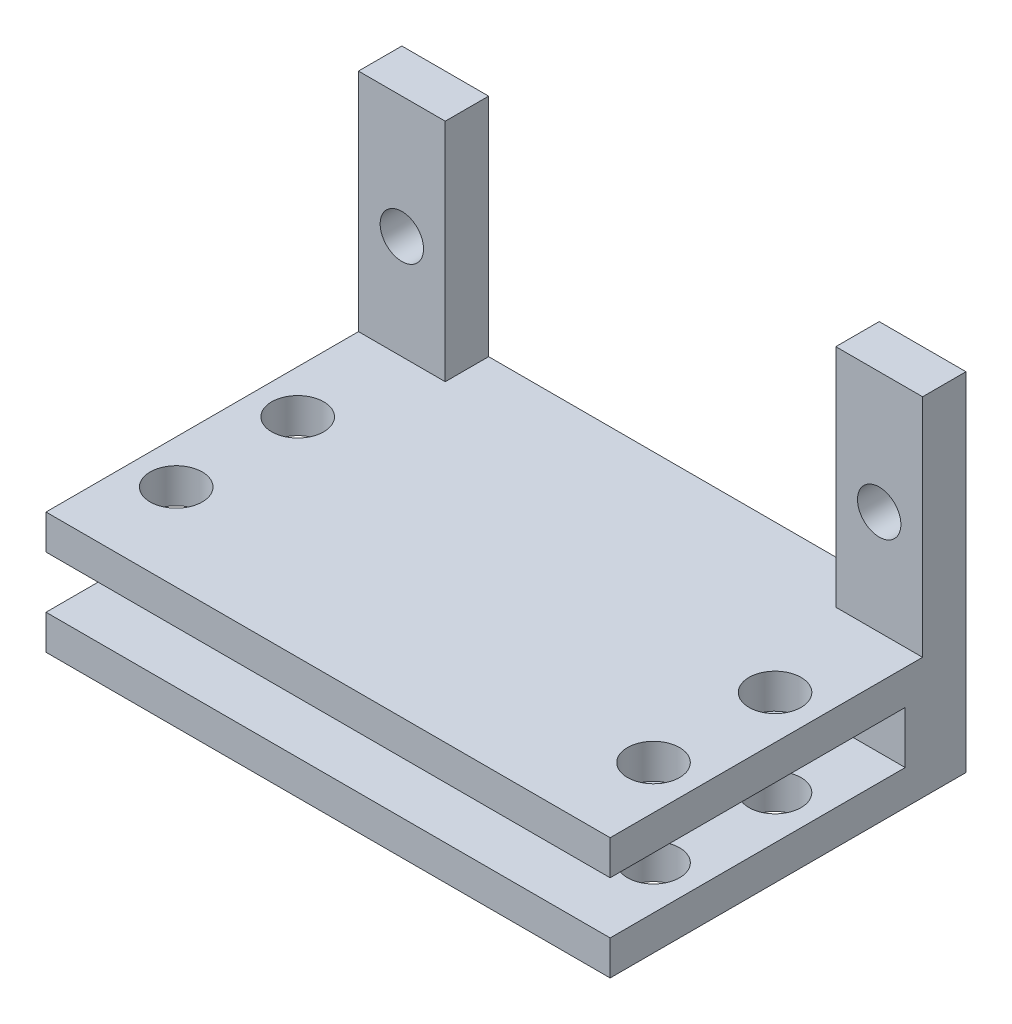
ISO-10303-21;
HEADER;
FILE_DESCRIPTION(('STEP AP214'),'2;1');
FILE_NAME('part.step','',(''),(''),'','','');
FILE_SCHEMA(('AUTOMOTIVE_DESIGN { 1 0 10303 214 1 1 1 1 }'));
ENDSEC;
DATA;
#1=APPLICATION_CONTEXT('core data for automotive mechanical design processes');
#2=APPLICATION_PROTOCOL_DEFINITION('international standard','automotive_design',2000,#1);
#3=PRODUCT_CONTEXT('',#1,'mechanical');
#4=PRODUCT('Part','Part','',(#3));
#5=PRODUCT_RELATED_PRODUCT_CATEGORY('part','',(#4));
#6=PRODUCT_DEFINITION_FORMATION('','',#4);
#7=PRODUCT_DEFINITION_CONTEXT('part definition',#1,'design');
#8=PRODUCT_DEFINITION('design','',#6,#7);
#9=PRODUCT_DEFINITION_SHAPE('','',#8);
#10=(LENGTH_UNIT() NAMED_UNIT(*) SI_UNIT(.MILLI.,.METRE.));
#11=(NAMED_UNIT(*) PLANE_ANGLE_UNIT() SI_UNIT($,.RADIAN.));
#12=(NAMED_UNIT(*) SI_UNIT($,.STERADIAN.) SOLID_ANGLE_UNIT());
#13=UNCERTAINTY_MEASURE_WITH_UNIT(LENGTH_MEASURE(1.E-05),#10,'distance_accuracy_value','');
#14=(GEOMETRIC_REPRESENTATION_CONTEXT(3) GLOBAL_UNCERTAINTY_ASSIGNED_CONTEXT((#13)) GLOBAL_UNIT_ASSIGNED_CONTEXT((#10,
#11,#12)) REPRESENTATION_CONTEXT('',''));
#15=CARTESIAN_POINT('',(0.,0.,0.));
#16=DIRECTION('',(0.,0.,1.));
#17=DIRECTION('',(1.,0.,0.));
#18=AXIS2_PLACEMENT_3D('',#15,#16,#17);
#19=CARTESIAN_POINT('',(0.,0.,20.5));
#20=DIRECTION('',(0.,1.,0.));
#21=DIRECTION('',(-1.,0.,0.));
#22=AXIS2_PLACEMENT_3D('',#19,#20,#21);
#23=PLANE('',#22);
#24=CARTESIAN_POINT('',(-13.75,0.,8.5));
#25=DIRECTION('',(0.,1.,0.));
#26=DIRECTION('',(-1.,0.,0.));
#27=AXIS2_PLACEMENT_3D('',#24,#25,#26);
#28=CIRCLE('',#27,1.5);
#29=CARTESIAN_POINT('',(-15.25,0.,8.5));
#30=VERTEX_POINT('',#29);
#31=EDGE_CURVE('E176',#30,#30,#28,.T.);
#32=ORIENTED_EDGE('',*,*,#31,.F.);
#33=EDGE_LOOP('',(#32));
#34=FACE_BOUND('',#33,.T.);
#35=CARTESIAN_POINT('',(-13.75,0.,15.5));
#36=DIRECTION('',(0.,1.,0.));
#37=DIRECTION('',(-1.,0.,0.));
#38=AXIS2_PLACEMENT_3D('',#35,#36,#37);
#39=CIRCLE('',#38,1.5);
#40=CARTESIAN_POINT('',(-15.25,0.,15.5));
#41=VERTEX_POINT('',#40);
#42=EDGE_CURVE('E417',#41,#41,#39,.T.);
#43=ORIENTED_EDGE('',*,*,#42,.F.);
#44=EDGE_LOOP('',(#43));
#45=FACE_BOUND('',#44,.T.);
#46=CARTESIAN_POINT('',(13.75,0.,15.5));
#47=DIRECTION('',(0.,1.,0.));
#48=DIRECTION('',(-1.,0.,0.));
#49=AXIS2_PLACEMENT_3D('',#46,#47,#48);
#50=CIRCLE('',#49,1.5);
#51=CARTESIAN_POINT('',(12.25,0.,15.5));
#52=VERTEX_POINT('',#51);
#53=EDGE_CURVE('E399',#52,#52,#50,.T.);
#54=ORIENTED_EDGE('',*,*,#53,.F.);
#55=EDGE_LOOP('',(#54));
#56=FACE_BOUND('',#55,.T.);
#57=CARTESIAN_POINT('',(13.75,0.,8.5));
#58=DIRECTION('',(0.,1.,0.));
#59=DIRECTION('',(-1.,0.,0.));
#60=AXIS2_PLACEMENT_3D('',#57,#58,#59);
#61=CIRCLE('',#60,1.5);
#62=CARTESIAN_POINT('',(12.25,0.,8.5));
#63=VERTEX_POINT('',#62);
#64=EDGE_CURVE('E408',#63,#63,#61,.T.);
#65=ORIENTED_EDGE('',*,*,#64,.F.);
#66=EDGE_LOOP('',(#65));
#67=FACE_BOUND('',#66,.T.);
#68=DIRECTION('',(1.,0.,0.));
#69=VECTOR('',#68,1.);
#70=CARTESIAN_POINT('',(0.,0.,0.));
#71=LINE('',#70,#69);
#72=CARTESIAN_POINT('',(-11.25,0.,0.));
#73=VERTEX_POINT('',#72);
#74=CARTESIAN_POINT('',(11.25,0.,0.));
#75=VERTEX_POINT('',#74);
#76=EDGE_CURVE('E220',#73,#75,#71,.T.);
#77=ORIENTED_EDGE('',*,*,#76,.F.);
#78=DIRECTION('',(0.,0.,-1.));
#79=VECTOR('',#78,1.);
#80=CARTESIAN_POINT('',(-11.25,0.,2.5));
#81=LINE('',#80,#79);
#82=CARTESIAN_POINT('',(-11.25,0.,2.5));
#83=VERTEX_POINT('',#82);
#84=EDGE_CURVE('E217',#83,#73,#81,.T.);
#85=ORIENTED_EDGE('',*,*,#84,.F.);
#86=DIRECTION('',(1.,0.,0.));
#87=VECTOR('',#86,1.);
#88=CARTESIAN_POINT('',(0.,0.,2.5));
#89=LINE('',#88,#87);
#90=CARTESIAN_POINT('',(-16.25,0.,2.5));
#91=VERTEX_POINT('',#90);
#92=EDGE_CURVE('E193',#91,#83,#89,.T.);
#93=ORIENTED_EDGE('',*,*,#92,.F.);
#94=DIRECTION('',(0.,0.,-1.));
#95=VECTOR('',#94,1.);
#96=CARTESIAN_POINT('',(-16.25,0.,20.5));
#97=LINE('',#96,#95);
#98=CARTESIAN_POINT('',(-16.25,0.,20.5));
#99=VERTEX_POINT('',#98);
#100=EDGE_CURVE('E237',#99,#91,#97,.T.);
#101=ORIENTED_EDGE('',*,*,#100,.F.);
#102=DIRECTION('',(1.,0.,0.));
#103=VECTOR('',#102,1.);
#104=CARTESIAN_POINT('',(0.,0.,20.5));
#105=LINE('',#104,#103);
#106=CARTESIAN_POINT('',(16.25,0.,20.5));
#107=VERTEX_POINT('',#106);
#108=EDGE_CURVE('E227',#99,#107,#105,.T.);
#109=ORIENTED_EDGE('',*,*,#108,.T.);
#110=DIRECTION('',(0.,0.,-1.));
#111=VECTOR('',#110,1.);
#112=CARTESIAN_POINT('',(16.25,0.,20.5));
#113=LINE('',#112,#111);
#114=CARTESIAN_POINT('',(16.25,0.,2.5));
#115=VERTEX_POINT('',#114);
#116=EDGE_CURVE('E240',#107,#115,#113,.T.);
#117=ORIENTED_EDGE('',*,*,#116,.T.);
#118=DIRECTION('',(1.,0.,0.));
#119=VECTOR('',#118,1.);
#120=CARTESIAN_POINT('',(0.,0.,2.5));
#121=LINE('',#120,#119);
#122=CARTESIAN_POINT('',(11.25,0.,2.5));
#123=VERTEX_POINT('',#122);
#124=EDGE_CURVE('E247',#123,#115,#121,.T.);
#125=ORIENTED_EDGE('',*,*,#124,.F.);
#126=DIRECTION('',(0.,0.,-1.));
#127=VECTOR('',#126,1.);
#128=CARTESIAN_POINT('',(11.25,0.,2.5));
#129=LINE('',#128,#127);
#130=EDGE_CURVE('E59',#123,#75,#129,.T.);
#131=ORIENTED_EDGE('',*,*,#130,.T.);
#132=EDGE_LOOP('',(#77,#85,#93,#101,#109,#117,#125,#131));
#133=FACE_BOUND('',#132,.T.);
#134=ADVANCED_FACE('F35',(#34,#45,#56,#67,#133),#23,.T.);
#135=CARTESIAN_POINT('',(16.25,0.,2.5));
#136=DIRECTION('',(-1.,0.,0.));
#137=DIRECTION('',(0.,0.,1.));
#138=AXIS2_PLACEMENT_3D('',#135,#136,#137);
#139=PLANE('',#138);
#140=DIRECTION('',(0.,1.,0.));
#141=VECTOR('',#140,1.);
#142=CARTESIAN_POINT('',(16.25,0.,0.));
#143=LINE('',#142,#141);
#144=CARTESIAN_POINT('',(16.25,-7.,0.));
#145=VERTEX_POINT('',#144);
#146=CARTESIAN_POINT('',(16.25,13.,0.));
#147=VERTEX_POINT('',#146);
#148=EDGE_CURVE('E246',#145,#147,#143,.T.);
#149=ORIENTED_EDGE('',*,*,#148,.T.);
#150=DIRECTION('',(0.,0.,-1.));
#151=VECTOR('',#150,1.);
#152=CARTESIAN_POINT('',(16.25,13.,2.5));
#153=LINE('',#152,#151);
#154=CARTESIAN_POINT('',(16.25,13.,2.5));
#155=VERTEX_POINT('',#154);
#156=EDGE_CURVE('E11',#155,#147,#153,.T.);
#157=ORIENTED_EDGE('',*,*,#156,.F.);
#158=DIRECTION('',(0.,1.,0.));
#159=VECTOR('',#158,1.);
#160=CARTESIAN_POINT('',(16.25,0.,2.5));
#161=LINE('',#160,#159);
#162=EDGE_CURVE('E80',#115,#155,#161,.T.);
#163=ORIENTED_EDGE('',*,*,#162,.F.);
#164=ORIENTED_EDGE('',*,*,#116,.F.);
#165=DIRECTION('',(0.,-1.,0.));
#166=VECTOR('',#165,1.);
#167=CARTESIAN_POINT('',(16.25,0.,20.5));
#168=LINE('',#167,#166);
#169=CARTESIAN_POINT('',(16.25,-2.,20.5));
#170=VERTEX_POINT('',#169);
#171=EDGE_CURVE('E223',#107,#170,#168,.T.);
#172=ORIENTED_EDGE('',*,*,#171,.T.);
#173=DIRECTION('',(0.,0.,-1.));
#174=VECTOR('',#173,1.);
#175=CARTESIAN_POINT('',(16.25,-2.,20.5));
#176=LINE('',#175,#174);
#177=CARTESIAN_POINT('',(16.25,-2.,3.5));
#178=VERTEX_POINT('',#177);
#179=EDGE_CURVE('E243',#170,#178,#176,.T.);
#180=ORIENTED_EDGE('',*,*,#179,.T.);
#181=DIRECTION('',(0.,-1.,0.));
#182=VECTOR('',#181,1.);
#183=CARTESIAN_POINT('',(16.25,0.,3.5));
#184=LINE('',#183,#182);
#185=CARTESIAN_POINT('',(16.25,-5.,3.5));
#186=VERTEX_POINT('',#185);
#187=EDGE_CURVE('E50',#178,#186,#184,.T.);
#188=ORIENTED_EDGE('',*,*,#187,.T.);
#189=DIRECTION('',(0.,0.,-1.));
#190=VECTOR('',#189,1.);
#191=CARTESIAN_POINT('',(16.25,-5.,20.5));
#192=LINE('',#191,#190);
#193=CARTESIAN_POINT('',(16.25,-5.,20.5));
#194=VERTEX_POINT('',#193);
#195=EDGE_CURVE('E166',#194,#186,#192,.T.);
#196=ORIENTED_EDGE('',*,*,#195,.F.);
#197=DIRECTION('',(0.,-1.,0.));
#198=VECTOR('',#197,1.);
#199=CARTESIAN_POINT('',(16.25,0.,20.5));
#200=LINE('',#199,#198);
#201=CARTESIAN_POINT('',(16.25,-7.,20.5));
#202=VERTEX_POINT('',#201);
#203=EDGE_CURVE('E151',#194,#202,#200,.T.);
#204=ORIENTED_EDGE('',*,*,#203,.T.);
#205=DIRECTION('',(0.,0.,-1.));
#206=VECTOR('',#205,1.);
#207=CARTESIAN_POINT('',(16.25,-7.,20.5));
#208=LINE('',#207,#206);
#209=EDGE_CURVE('E162',#202,#145,#208,.T.);
#210=ORIENTED_EDGE('',*,*,#209,.T.);
#211=EDGE_LOOP('',(#149,#157,#163,#164,#172,#180,#188,#196,#204,#210));
#212=FACE_BOUND('',#211,.T.);
#213=ADVANCED_FACE('F37',(#212),#139,.F.);
#214=CARTESIAN_POINT('',(0.,13.,2.5));
#215=DIRECTION('',(0.,-1.,0.));
#216=DIRECTION('',(1.,0.,0.));
#217=AXIS2_PLACEMENT_3D('',#214,#215,#216);
#218=PLANE('',#217);
#219=DIRECTION('',(-1.,0.,0.));
#220=VECTOR('',#219,1.);
#221=CARTESIAN_POINT('',(0.,13.,0.));
#222=LINE('',#221,#220);
#223=CARTESIAN_POINT('',(11.25,13.,0.));
#224=VERTEX_POINT('',#223);
#225=EDGE_CURVE('E259',#147,#224,#222,.T.);
#226=ORIENTED_EDGE('',*,*,#225,.T.);
#227=DIRECTION('',(0.,0.,-1.));
#228=VECTOR('',#227,1.);
#229=CARTESIAN_POINT('',(11.25,13.,2.5));
#230=LINE('',#229,#228);
#231=CARTESIAN_POINT('',(11.25,13.,2.5));
#232=VERTEX_POINT('',#231);
#233=EDGE_CURVE('E43',#232,#224,#230,.T.);
#234=ORIENTED_EDGE('',*,*,#233,.F.);
#235=DIRECTION('',(-1.,0.,0.));
#236=VECTOR('',#235,1.);
#237=CARTESIAN_POINT('',(0.,13.,2.5));
#238=LINE('',#237,#236);
#239=EDGE_CURVE('E251',#155,#232,#238,.T.);
#240=ORIENTED_EDGE('',*,*,#239,.F.);
#241=ORIENTED_EDGE('',*,*,#156,.T.);
#242=EDGE_LOOP('',(#226,#234,#240,#241));
#243=FACE_BOUND('',#242,.T.);
#244=ADVANCED_FACE('F277',(#243),#218,.F.);
#245=CARTESIAN_POINT('',(11.25,0.,2.5));
#246=DIRECTION('',(-1.,0.,0.));
#247=DIRECTION('',(0.,-1.,0.));
#248=AXIS2_PLACEMENT_3D('',#245,#246,#247);
#249=PLANE('',#248);
#250=DIRECTION('',(0.,1.,0.));
#251=VECTOR('',#250,1.);
#252=CARTESIAN_POINT('',(11.25,0.,0.));
#253=LINE('',#252,#251);
#254=EDGE_CURVE('E261',#75,#224,#253,.T.);
#255=ORIENTED_EDGE('',*,*,#254,.F.);
#256=ORIENTED_EDGE('',*,*,#130,.F.);
#257=DIRECTION('',(0.,1.,0.));
#258=VECTOR('',#257,1.);
#259=CARTESIAN_POINT('',(11.25,0.,2.5));
#260=LINE('',#259,#258);
#261=EDGE_CURVE('E253',#123,#232,#260,.T.);
#262=ORIENTED_EDGE('',*,*,#261,.T.);
#263=ORIENTED_EDGE('',*,*,#233,.T.);
#264=EDGE_LOOP('',(#255,#256,#262,#263));
#265=FACE_BOUND('',#264,.T.);
#266=ADVANCED_FACE('F274',(#265),#249,.T.);
#267=CARTESIAN_POINT('',(13.75,6.,2.5));
#268=DIRECTION('',(0.,0.,-1.));
#269=DIRECTION('',(-1.,0.,0.));
#270=AXIS2_PLACEMENT_3D('',#267,#268,#269);
#271=CYLINDRICAL_SURFACE('',#270,1.25);
#272=CARTESIAN_POINT('',(13.75,6.,2.5));
#273=DIRECTION('',(0.,0.,1.));
#274=DIRECTION('',(1.,0.,0.));
#275=AXIS2_PLACEMENT_3D('',#272,#273,#274);
#276=CIRCLE('',#275,1.25);
#277=CARTESIAN_POINT('',(15.,6.,2.5));
#278=VERTEX_POINT('',#277);
#279=EDGE_CURVE('E255',#278,#278,#276,.F.);
#280=ORIENTED_EDGE('',*,*,#279,.F.);
#281=EDGE_LOOP('',(#280));
#282=FACE_BOUND('',#281,.T.);
#283=CARTESIAN_POINT('',(13.75,6.,0.));
#284=DIRECTION('',(0.,0.,1.));
#285=DIRECTION('',(1.,0.,0.));
#286=AXIS2_PLACEMENT_3D('',#283,#284,#285);
#287=CIRCLE('',#286,1.25);
#288=CARTESIAN_POINT('',(15.,6.,0.));
#289=VERTEX_POINT('',#288);
#290=EDGE_CURVE('E249',#289,#289,#287,.F.);
#291=ORIENTED_EDGE('',*,*,#290,.T.);
#292=EDGE_LOOP('',(#291));
#293=FACE_BOUND('',#292,.T.);
#294=ADVANCED_FACE('F276',(#282,#293),#271,.F.);
#295=CARTESIAN_POINT('',(0.,0.,2.5));
#296=DIRECTION('',(0.,0.,1.));
#297=DIRECTION('',(1.,0.,0.));
#298=AXIS2_PLACEMENT_3D('',#295,#296,#297);
#299=PLANE('',#298);
#300=ORIENTED_EDGE('',*,*,#124,.T.);
#301=ORIENTED_EDGE('',*,*,#162,.T.);
#302=ORIENTED_EDGE('',*,*,#239,.T.);
#303=ORIENTED_EDGE('',*,*,#261,.F.);
#304=EDGE_LOOP('',(#300,#301,#302,#303));
#305=FACE_BOUND('',#304,.T.);
#306=ORIENTED_EDGE('',*,*,#279,.T.);
#307=EDGE_LOOP('',(#306));
#308=FACE_BOUND('',#307,.T.);
#309=ADVANCED_FACE('F271',(#305,#308),#299,.T.);
#310=CARTESIAN_POINT('',(0.,0.,0.));
#311=DIRECTION('',(0.,0.,1.));
#312=DIRECTION('',(1.,0.,0.));
#313=AXIS2_PLACEMENT_3D('',#310,#311,#312);
#314=PLANE('',#313);
#315=ORIENTED_EDGE('',*,*,#148,.F.);
#316=DIRECTION('',(1.,0.,0.));
#317=VECTOR('',#316,1.);
#318=CARTESIAN_POINT('',(0.,-7.,0.));
#319=LINE('',#318,#317);
#320=CARTESIAN_POINT('',(-16.25,-7.,0.));
#321=VERTEX_POINT('',#320);
#322=EDGE_CURVE('E158',#321,#145,#319,.T.);
#323=ORIENTED_EDGE('',*,*,#322,.F.);
#324=DIRECTION('',(0.,-1.,0.));
#325=VECTOR('',#324,1.);
#326=CARTESIAN_POINT('',(-16.25,0.,0.));
#327=LINE('',#326,#325);
#328=CARTESIAN_POINT('',(-16.25,13.,0.));
#329=VERTEX_POINT('',#328);
#330=EDGE_CURVE('E224',#329,#321,#327,.T.);
#331=ORIENTED_EDGE('',*,*,#330,.F.);
#332=DIRECTION('',(1.,0.,0.));
#333=VECTOR('',#332,1.);
#334=CARTESIAN_POINT('',(0.,13.,0.));
#335=LINE('',#334,#333);
#336=CARTESIAN_POINT('',(-11.25,13.,0.));
#337=VERTEX_POINT('',#336);
#338=EDGE_CURVE('E194',#329,#337,#335,.T.);
#339=ORIENTED_EDGE('',*,*,#338,.T.);
#340=DIRECTION('',(0.,1.,0.));
#341=VECTOR('',#340,1.);
#342=CARTESIAN_POINT('',(-11.25,0.,0.));
#343=LINE('',#342,#341);
#344=EDGE_CURVE('E208',#73,#337,#343,.T.);
#345=ORIENTED_EDGE('',*,*,#344,.F.);
#346=ORIENTED_EDGE('',*,*,#76,.T.);
#347=ORIENTED_EDGE('',*,*,#254,.T.);
#348=ORIENTED_EDGE('',*,*,#225,.F.);
#349=EDGE_LOOP('',(#315,#323,#331,#339,#345,#346,#347,#348));
#350=FACE_BOUND('',#349,.T.);
#351=ORIENTED_EDGE('',*,*,#290,.F.);
#352=EDGE_LOOP('',(#351));
#353=FACE_BOUND('',#352,.T.);
#354=CARTESIAN_POINT('',(-13.75,6.,0.));
#355=DIRECTION('',(0.,0.,1.));
#356=DIRECTION('',(1.,0.,0.));
#357=AXIS2_PLACEMENT_3D('',#354,#355,#356);
#358=CIRCLE('',#357,1.25);
#359=CARTESIAN_POINT('',(-12.5,6.,0.));
#360=VERTEX_POINT('',#359);
#361=EDGE_CURVE('E189',#360,#360,#358,.T.);
#362=ORIENTED_EDGE('',*,*,#361,.T.);
#363=EDGE_LOOP('',(#362));
#364=FACE_BOUND('',#363,.T.);
#365=ADVANCED_FACE('F301',(#350,#353,#364),#314,.F.);
#366=CARTESIAN_POINT('',(0.,-2.,20.5));
#367=DIRECTION('',(0.,1.,0.));
#368=DIRECTION('',(-1.,0.,0.));
#369=AXIS2_PLACEMENT_3D('',#366,#367,#368);
#370=PLANE('',#369);
#371=CARTESIAN_POINT('',(-13.75,-2.,8.5));
#372=DIRECTION('',(0.,1.,0.));
#373=DIRECTION('',(-1.,0.,0.));
#374=AXIS2_PLACEMENT_3D('',#371,#372,#373);
#375=CIRCLE('',#374,1.5);
#376=CARTESIAN_POINT('',(-15.25,-2.,8.5));
#377=VERTEX_POINT('',#376);
#378=EDGE_CURVE('E423',#377,#377,#375,.T.);
#379=ORIENTED_EDGE('',*,*,#378,.T.);
#380=EDGE_LOOP('',(#379));
#381=FACE_BOUND('',#380,.T.);
#382=CARTESIAN_POINT('',(-13.75,-2.,15.5));
#383=DIRECTION('',(0.,1.,0.));
#384=DIRECTION('',(-1.,0.,0.));
#385=AXIS2_PLACEMENT_3D('',#382,#383,#384);
#386=CIRCLE('',#385,1.5);
#387=CARTESIAN_POINT('',(-15.25,-2.,15.5));
#388=VERTEX_POINT('',#387);
#389=EDGE_CURVE('E414',#388,#388,#386,.T.);
#390=ORIENTED_EDGE('',*,*,#389,.T.);
#391=EDGE_LOOP('',(#390));
#392=FACE_BOUND('',#391,.T.);
#393=CARTESIAN_POINT('',(13.75,-2.,15.5));
#394=DIRECTION('',(0.,1.,0.));
#395=DIRECTION('',(-1.,0.,0.));
#396=AXIS2_PLACEMENT_3D('',#393,#394,#395);
#397=CIRCLE('',#396,1.5);
#398=CARTESIAN_POINT('',(12.25,-2.,15.5));
#399=VERTEX_POINT('',#398);
#400=EDGE_CURVE('E402',#399,#399,#397,.T.);
#401=ORIENTED_EDGE('',*,*,#400,.T.);
#402=EDGE_LOOP('',(#401));
#403=FACE_BOUND('',#402,.T.);
#404=CARTESIAN_POINT('',(13.75,-2.,8.5));
#405=DIRECTION('',(0.,1.,0.));
#406=DIRECTION('',(-1.,0.,0.));
#407=AXIS2_PLACEMENT_3D('',#404,#405,#406);
#408=CIRCLE('',#407,1.5);
#409=CARTESIAN_POINT('',(12.25,-2.,8.5));
#410=VERTEX_POINT('',#409);
#411=EDGE_CURVE('E435',#410,#410,#408,.T.);
#412=ORIENTED_EDGE('',*,*,#411,.T.);
#413=EDGE_LOOP('',(#412));
#414=FACE_BOUND('',#413,.T.);
#415=DIRECTION('',(0.,0.,-1.));
#416=VECTOR('',#415,1.);
#417=CARTESIAN_POINT('',(-16.25,-2.,20.5));
#418=LINE('',#417,#416);
#419=CARTESIAN_POINT('',(-16.25,-2.,20.5));
#420=VERTEX_POINT('',#419);
#421=CARTESIAN_POINT('',(-16.25,-2.,3.5));
#422=VERTEX_POINT('',#421);
#423=EDGE_CURVE('E232',#420,#422,#418,.T.);
#424=ORIENTED_EDGE('',*,*,#423,.T.);
#425=DIRECTION('',(1.,0.,0.));
#426=VECTOR('',#425,1.);
#427=CARTESIAN_POINT('',(0.,-2.,3.5));
#428=LINE('',#427,#426);
#429=EDGE_CURVE('E184',#422,#178,#428,.T.);
#430=ORIENTED_EDGE('',*,*,#429,.T.);
#431=ORIENTED_EDGE('',*,*,#179,.F.);
#432=DIRECTION('',(1.,0.,0.));
#433=VECTOR('',#432,1.);
#434=CARTESIAN_POINT('',(0.,-2.,20.5));
#435=LINE('',#434,#433);
#436=EDGE_CURVE('E221',#420,#170,#435,.T.);
#437=ORIENTED_EDGE('',*,*,#436,.F.);
#438=EDGE_LOOP('',(#424,#430,#431,#437));
#439=FACE_BOUND('',#438,.T.);
#440=ADVANCED_FACE('F298',(#381,#392,#403,#414,#439),#370,.F.);
#441=CARTESIAN_POINT('',(-16.25,0.,20.5));
#442=DIRECTION('',(1.,0.,0.));
#443=DIRECTION('',(0.,0.,-1.));
#444=AXIS2_PLACEMENT_3D('',#441,#442,#443);
#445=PLANE('',#444);
#446=ORIENTED_EDGE('',*,*,#330,.T.);
#447=DIRECTION('',(0.,0.,-1.));
#448=VECTOR('',#447,1.);
#449=CARTESIAN_POINT('',(-16.25,-7.,20.5));
#450=LINE('',#449,#448);
#451=CARTESIAN_POINT('',(-16.25,-7.,20.5));
#452=VERTEX_POINT('',#451);
#453=EDGE_CURVE('E174',#452,#321,#450,.T.);
#454=ORIENTED_EDGE('',*,*,#453,.F.);
#455=DIRECTION('',(0.,-1.,0.));
#456=VECTOR('',#455,1.);
#457=CARTESIAN_POINT('',(-16.25,0.,20.5));
#458=LINE('',#457,#456);
#459=CARTESIAN_POINT('',(-16.25,-5.,20.5));
#460=VERTEX_POINT('',#459);
#461=EDGE_CURVE('E154',#460,#452,#458,.T.);
#462=ORIENTED_EDGE('',*,*,#461,.F.);
#463=DIRECTION('',(0.,0.,-1.));
#464=VECTOR('',#463,1.);
#465=CARTESIAN_POINT('',(-16.25,-5.,20.5));
#466=LINE('',#465,#464);
#467=CARTESIAN_POINT('',(-16.25,-5.,3.5));
#468=VERTEX_POINT('',#467);
#469=EDGE_CURVE('E178',#460,#468,#466,.T.);
#470=ORIENTED_EDGE('',*,*,#469,.T.);
#471=DIRECTION('',(0.,-1.,0.));
#472=VECTOR('',#471,1.);
#473=CARTESIAN_POINT('',(-16.25,0.,3.5));
#474=LINE('',#473,#472);
#475=EDGE_CURVE('E186',#422,#468,#474,.T.);
#476=ORIENTED_EDGE('',*,*,#475,.F.);
#477=ORIENTED_EDGE('',*,*,#423,.F.);
#478=DIRECTION('',(0.,-1.,0.));
#479=VECTOR('',#478,1.);
#480=CARTESIAN_POINT('',(-16.25,0.,20.5));
#481=LINE('',#480,#479);
#482=EDGE_CURVE('E230',#99,#420,#481,.T.);
#483=ORIENTED_EDGE('',*,*,#482,.F.);
#484=ORIENTED_EDGE('',*,*,#100,.T.);
#485=DIRECTION('',(0.,1.,0.));
#486=VECTOR('',#485,1.);
#487=CARTESIAN_POINT('',(-16.25,0.,2.5));
#488=LINE('',#487,#486);
#489=CARTESIAN_POINT('',(-16.25,13.,2.5));
#490=VERTEX_POINT('',#489);
#491=EDGE_CURVE('E202',#91,#490,#488,.T.);
#492=ORIENTED_EDGE('',*,*,#491,.T.);
#493=DIRECTION('',(0.,0.,-1.));
#494=VECTOR('',#493,1.);
#495=CARTESIAN_POINT('',(-16.25,13.,2.5));
#496=LINE('',#495,#494);
#497=EDGE_CURVE('E205',#490,#329,#496,.T.);
#498=ORIENTED_EDGE('',*,*,#497,.T.);
#499=EDGE_LOOP('',(#446,#454,#462,#470,#476,#477,#483,#484,#492,#498));
#500=FACE_BOUND('',#499,.T.);
#501=ADVANCED_FACE('F296',(#500),#445,.F.);
#502=CARTESIAN_POINT('',(0.,0.,20.5));
#503=DIRECTION('',(0.,0.,1.));
#504=DIRECTION('',(1.,0.,0.));
#505=AXIS2_PLACEMENT_3D('',#502,#503,#504);
#506=PLANE('',#505);
#507=ORIENTED_EDGE('',*,*,#436,.T.);
#508=ORIENTED_EDGE('',*,*,#171,.F.);
#509=ORIENTED_EDGE('',*,*,#108,.F.);
#510=ORIENTED_EDGE('',*,*,#482,.T.);
#511=EDGE_LOOP('',(#507,#508,#509,#510));
#512=FACE_BOUND('',#511,.T.);
#513=ADVANCED_FACE('F332',(#512),#506,.T.);
#514=CARTESIAN_POINT('',(-11.25,0.,2.5));
#515=DIRECTION('',(-1.,0.,0.));
#516=DIRECTION('',(0.,-1.,0.));
#517=AXIS2_PLACEMENT_3D('',#514,#515,#516);
#518=PLANE('',#517);
#519=ORIENTED_EDGE('',*,*,#344,.T.);
#520=DIRECTION('',(0.,0.,-1.));
#521=VECTOR('',#520,1.);
#522=CARTESIAN_POINT('',(-11.25,13.,2.5));
#523=LINE('',#522,#521);
#524=CARTESIAN_POINT('',(-11.25,13.,2.5));
#525=VERTEX_POINT('',#524);
#526=EDGE_CURVE('E215',#525,#337,#523,.T.);
#527=ORIENTED_EDGE('',*,*,#526,.F.);
#528=DIRECTION('',(0.,1.,0.));
#529=VECTOR('',#528,1.);
#530=CARTESIAN_POINT('',(-11.25,0.,2.5));
#531=LINE('',#530,#529);
#532=EDGE_CURVE('E197',#83,#525,#531,.T.);
#533=ORIENTED_EDGE('',*,*,#532,.F.);
#534=ORIENTED_EDGE('',*,*,#84,.T.);
#535=EDGE_LOOP('',(#519,#527,#533,#534));
#536=FACE_BOUND('',#535,.T.);
#537=ADVANCED_FACE('F328',(#536),#518,.F.);
#538=CARTESIAN_POINT('',(0.,13.,2.5));
#539=DIRECTION('',(0.,1.,0.));
#540=DIRECTION('',(-1.,0.,0.));
#541=AXIS2_PLACEMENT_3D('',#538,#539,#540);
#542=PLANE('',#541);
#543=ORIENTED_EDGE('',*,*,#338,.F.);
#544=ORIENTED_EDGE('',*,*,#497,.F.);
#545=DIRECTION('',(1.,0.,0.));
#546=VECTOR('',#545,1.);
#547=CARTESIAN_POINT('',(0.,13.,2.5));
#548=LINE('',#547,#546);
#549=EDGE_CURVE('E199',#490,#525,#548,.T.);
#550=ORIENTED_EDGE('',*,*,#549,.T.);
#551=ORIENTED_EDGE('',*,*,#526,.T.);
#552=EDGE_LOOP('',(#543,#544,#550,#551));
#553=FACE_BOUND('',#552,.T.);
#554=ADVANCED_FACE('F318',(#553),#542,.T.);
#555=CARTESIAN_POINT('',(-13.75,6.,2.5));
#556=DIRECTION('',(0.,0.,-1.));
#557=DIRECTION('',(-1.,0.,0.));
#558=AXIS2_PLACEMENT_3D('',#555,#556,#557);
#559=CYLINDRICAL_SURFACE('',#558,1.25);
#560=CARTESIAN_POINT('',(-13.75,6.,2.5));
#561=DIRECTION('',(0.,0.,1.));
#562=DIRECTION('',(1.,0.,0.));
#563=AXIS2_PLACEMENT_3D('',#560,#561,#562);
#564=CIRCLE('',#563,1.25);
#565=CARTESIAN_POINT('',(-12.5,6.,2.5));
#566=VERTEX_POINT('',#565);
#567=EDGE_CURVE('E190',#566,#566,#564,.T.);
#568=ORIENTED_EDGE('',*,*,#567,.T.);
#569=EDGE_LOOP('',(#568));
#570=FACE_BOUND('',#569,.T.);
#571=ORIENTED_EDGE('',*,*,#361,.F.);
#572=EDGE_LOOP('',(#571));
#573=FACE_BOUND('',#572,.T.);
#574=ADVANCED_FACE('F315',(#570,#573),#559,.F.);
#575=CARTESIAN_POINT('',(0.,0.,2.5));
#576=DIRECTION('',(0.,0.,1.));
#577=DIRECTION('',(1.,0.,0.));
#578=AXIS2_PLACEMENT_3D('',#575,#576,#577);
#579=PLANE('',#578);
#580=ORIENTED_EDGE('',*,*,#567,.F.);
#581=EDGE_LOOP('',(#580));
#582=FACE_BOUND('',#581,.T.);
#583=ORIENTED_EDGE('',*,*,#92,.T.);
#584=ORIENTED_EDGE('',*,*,#532,.T.);
#585=ORIENTED_EDGE('',*,*,#549,.F.);
#586=ORIENTED_EDGE('',*,*,#491,.F.);
#587=EDGE_LOOP('',(#583,#584,#585,#586));
#588=FACE_BOUND('',#587,.T.);
#589=ADVANCED_FACE('F317',(#582,#588),#579,.T.);
#590=CARTESIAN_POINT('',(0.,0.,3.5));
#591=DIRECTION('',(0.,0.,1.));
#592=DIRECTION('',(1.,0.,0.));
#593=AXIS2_PLACEMENT_3D('',#590,#591,#592);
#594=PLANE('',#593);
#595=DIRECTION('',(1.,0.,0.));
#596=VECTOR('',#595,1.);
#597=CARTESIAN_POINT('',(0.,-5.,3.5));
#598=LINE('',#597,#596);
#599=EDGE_CURVE('E165',#468,#186,#598,.T.);
#600=ORIENTED_EDGE('',*,*,#599,.T.);
#601=ORIENTED_EDGE('',*,*,#187,.F.);
#602=ORIENTED_EDGE('',*,*,#429,.F.);
#603=ORIENTED_EDGE('',*,*,#475,.T.);
#604=EDGE_LOOP('',(#600,#601,#602,#603));
#605=FACE_BOUND('',#604,.T.);
#606=ADVANCED_FACE('F325',(#605),#594,.T.);
#607=CARTESIAN_POINT('',(0.,-5.,20.5));
#608=DIRECTION('',(0.,1.,0.));
#609=DIRECTION('',(-1.,0.,0.));
#610=AXIS2_PLACEMENT_3D('',#607,#608,#609);
#611=PLANE('',#610);
#612=CARTESIAN_POINT('',(-13.75,-5.,8.5));
#613=DIRECTION('',(0.,1.,0.));
#614=DIRECTION('',(-1.,0.,0.));
#615=AXIS2_PLACEMENT_3D('',#612,#613,#614);
#616=CIRCLE('',#615,1.5);
#617=CARTESIAN_POINT('',(-15.25,-5.,8.5));
#618=VERTEX_POINT('',#617);
#619=EDGE_CURVE('E420',#618,#618,#616,.T.);
#620=ORIENTED_EDGE('',*,*,#619,.F.);
#621=EDGE_LOOP('',(#620));
#622=FACE_BOUND('',#621,.T.);
#623=CARTESIAN_POINT('',(-13.75,-5.,15.5));
#624=DIRECTION('',(0.,1.,0.));
#625=DIRECTION('',(-1.,0.,0.));
#626=AXIS2_PLACEMENT_3D('',#623,#624,#625);
#627=CIRCLE('',#626,1.5);
#628=CARTESIAN_POINT('',(-15.25,-5.,15.5));
#629=VERTEX_POINT('',#628);
#630=EDGE_CURVE('E406',#629,#629,#627,.T.);
#631=ORIENTED_EDGE('',*,*,#630,.F.);
#632=EDGE_LOOP('',(#631));
#633=FACE_BOUND('',#632,.T.);
#634=CARTESIAN_POINT('',(13.75,-5.,15.5));
#635=DIRECTION('',(0.,1.,0.));
#636=DIRECTION('',(-1.,0.,0.));
#637=AXIS2_PLACEMENT_3D('',#634,#635,#636);
#638=CIRCLE('',#637,1.5);
#639=CARTESIAN_POINT('',(12.25,-5.,15.5));
#640=VERTEX_POINT('',#639);
#641=EDGE_CURVE('E404',#640,#640,#638,.T.);
#642=ORIENTED_EDGE('',*,*,#641,.F.);
#643=EDGE_LOOP('',(#642));
#644=FACE_BOUND('',#643,.T.);
#645=CARTESIAN_POINT('',(13.75,-5.,8.5));
#646=DIRECTION('',(0.,1.,0.));
#647=DIRECTION('',(-1.,0.,0.));
#648=AXIS2_PLACEMENT_3D('',#645,#646,#647);
#649=CIRCLE('',#648,1.5);
#650=CARTESIAN_POINT('',(12.25,-5.,8.5));
#651=VERTEX_POINT('',#650);
#652=EDGE_CURVE('E437',#651,#651,#649,.T.);
#653=ORIENTED_EDGE('',*,*,#652,.F.);
#654=EDGE_LOOP('',(#653));
#655=FACE_BOUND('',#654,.T.);
#656=ORIENTED_EDGE('',*,*,#599,.F.);
#657=ORIENTED_EDGE('',*,*,#469,.F.);
#658=DIRECTION('',(1.,0.,0.));
#659=VECTOR('',#658,1.);
#660=CARTESIAN_POINT('',(0.,-5.,20.5));
#661=LINE('',#660,#659);
#662=EDGE_CURVE('E168',#460,#194,#661,.T.);
#663=ORIENTED_EDGE('',*,*,#662,.T.);
#664=ORIENTED_EDGE('',*,*,#195,.T.);
#665=EDGE_LOOP('',(#656,#657,#663,#664));
#666=FACE_BOUND('',#665,.T.);
#667=ADVANCED_FACE('F349',(#622,#633,#644,#655,#666),#611,.T.);
#668=CARTESIAN_POINT('',(0.,-7.,20.5));
#669=DIRECTION('',(0.,1.,0.));
#670=DIRECTION('',(-1.,0.,0.));
#671=AXIS2_PLACEMENT_3D('',#668,#669,#670);
#672=PLANE('',#671);
#673=CARTESIAN_POINT('',(-13.75,-7.,8.5));
#674=DIRECTION('',(0.,1.,0.));
#675=DIRECTION('',(1.,0.,0.));
#676=AXIS2_PLACEMENT_3D('',#673,#674,#675);
#677=CIRCLE('',#676,1.5);
#678=CARTESIAN_POINT('',(-12.25,-7.,8.5));
#679=VERTEX_POINT('',#678);
#680=EDGE_CURVE('E447',#679,#679,#677,.T.);
#681=ORIENTED_EDGE('',*,*,#680,.T.);
#682=EDGE_LOOP('',(#681));
#683=FACE_BOUND('',#682,.T.);
#684=CARTESIAN_POINT('',(-13.75,-7.,15.5));
#685=DIRECTION('',(0.,1.,0.));
#686=DIRECTION('',(1.,0.,0.));
#687=AXIS2_PLACEMENT_3D('',#684,#685,#686);
#688=CIRCLE('',#687,1.5);
#689=CARTESIAN_POINT('',(-12.25,-7.,15.5));
#690=VERTEX_POINT('',#689);
#691=EDGE_CURVE('E450',#690,#690,#688,.T.);
#692=ORIENTED_EDGE('',*,*,#691,.T.);
#693=EDGE_LOOP('',(#692));
#694=FACE_BOUND('',#693,.T.);
#695=CARTESIAN_POINT('',(13.75,-7.,15.5));
#696=DIRECTION('',(0.,1.,0.));
#697=DIRECTION('',(-1.,0.,0.));
#698=AXIS2_PLACEMENT_3D('',#695,#696,#697);
#699=CIRCLE('',#698,1.5);
#700=CARTESIAN_POINT('',(12.25,-7.,15.5));
#701=VERTEX_POINT('',#700);
#702=EDGE_CURVE('E446',#701,#701,#699,.T.);
#703=ORIENTED_EDGE('',*,*,#702,.T.);
#704=EDGE_LOOP('',(#703));
#705=FACE_BOUND('',#704,.T.);
#706=CARTESIAN_POINT('',(13.75,-7.,8.5));
#707=DIRECTION('',(0.,1.,0.));
#708=DIRECTION('',(-1.,0.,0.));
#709=AXIS2_PLACEMENT_3D('',#706,#707,#708);
#710=CIRCLE('',#709,1.5);
#711=CARTESIAN_POINT('',(12.25,-7.,8.5));
#712=VERTEX_POINT('',#711);
#713=EDGE_CURVE('E441',#712,#712,#710,.T.);
#714=ORIENTED_EDGE('',*,*,#713,.T.);
#715=EDGE_LOOP('',(#714));
#716=FACE_BOUND('',#715,.T.);
#717=ORIENTED_EDGE('',*,*,#322,.T.);
#718=ORIENTED_EDGE('',*,*,#209,.F.);
#719=DIRECTION('',(1.,0.,0.));
#720=VECTOR('',#719,1.);
#721=CARTESIAN_POINT('',(0.,-7.,20.5));
#722=LINE('',#721,#720);
#723=EDGE_CURVE('E146',#452,#202,#722,.T.);
#724=ORIENTED_EDGE('',*,*,#723,.F.);
#725=ORIENTED_EDGE('',*,*,#453,.T.);
#726=EDGE_LOOP('',(#717,#718,#724,#725));
#727=FACE_BOUND('',#726,.T.);
#728=ADVANCED_FACE('F163',(#683,#694,#705,#716,#727),#672,.F.);
#729=CARTESIAN_POINT('',(0.,0.,20.5));
#730=DIRECTION('',(0.,0.,1.));
#731=DIRECTION('',(1.,0.,0.));
#732=AXIS2_PLACEMENT_3D('',#729,#730,#731);
#733=PLANE('',#732);
#734=ORIENTED_EDGE('',*,*,#723,.T.);
#735=ORIENTED_EDGE('',*,*,#203,.F.);
#736=ORIENTED_EDGE('',*,*,#662,.F.);
#737=ORIENTED_EDGE('',*,*,#461,.T.);
#738=EDGE_LOOP('',(#734,#735,#736,#737));
#739=FACE_BOUND('',#738,.T.);
#740=ADVANCED_FACE('F148',(#739),#733,.T.);
#741=CARTESIAN_POINT('',(13.75,-7.,8.5));
#742=DIRECTION('',(0.,1.,0.));
#743=DIRECTION('',(-1.,0.,0.));
#744=AXIS2_PLACEMENT_3D('',#741,#742,#743);
#745=CYLINDRICAL_SURFACE('',#744,1.5);
#746=ORIENTED_EDGE('',*,*,#652,.T.);
#747=EDGE_LOOP('',(#746));
#748=FACE_BOUND('',#747,.T.);
#749=ORIENTED_EDGE('',*,*,#713,.F.);
#750=EDGE_LOOP('',(#749));
#751=FACE_BOUND('',#750,.T.);
#752=ADVANCED_FACE('F365',(#748,#751),#745,.F.);
#753=CARTESIAN_POINT('',(13.75,-7.,15.5));
#754=DIRECTION('',(0.,1.,0.));
#755=DIRECTION('',(-1.,0.,0.));
#756=AXIS2_PLACEMENT_3D('',#753,#754,#755);
#757=CYLINDRICAL_SURFACE('',#756,1.5);
#758=ORIENTED_EDGE('',*,*,#641,.T.);
#759=EDGE_LOOP('',(#758));
#760=FACE_BOUND('',#759,.T.);
#761=ORIENTED_EDGE('',*,*,#702,.F.);
#762=EDGE_LOOP('',(#761));
#763=FACE_BOUND('',#762,.T.);
#764=ADVANCED_FACE('F368',(#760,#763),#757,.F.);
#765=CARTESIAN_POINT('',(-13.75,-7.,15.5));
#766=DIRECTION('',(0.,1.,0.));
#767=DIRECTION('',(-1.,0.,0.));
#768=AXIS2_PLACEMENT_3D('',#765,#766,#767);
#769=CYLINDRICAL_SURFACE('',#768,1.5);
#770=ORIENTED_EDGE('',*,*,#630,.T.);
#771=EDGE_LOOP('',(#770));
#772=FACE_BOUND('',#771,.T.);
#773=ORIENTED_EDGE('',*,*,#691,.F.);
#774=EDGE_LOOP('',(#773));
#775=FACE_BOUND('',#774,.T.);
#776=ADVANCED_FACE('F374',(#772,#775),#769,.F.);
#777=CARTESIAN_POINT('',(-13.75,-7.,8.5));
#778=DIRECTION('',(0.,1.,0.));
#779=DIRECTION('',(-1.,0.,0.));
#780=AXIS2_PLACEMENT_3D('',#777,#778,#779);
#781=CYLINDRICAL_SURFACE('',#780,1.5);
#782=ORIENTED_EDGE('',*,*,#619,.T.);
#783=EDGE_LOOP('',(#782));
#784=FACE_BOUND('',#783,.T.);
#785=ORIENTED_EDGE('',*,*,#680,.F.);
#786=EDGE_LOOP('',(#785));
#787=FACE_BOUND('',#786,.T.);
#788=ADVANCED_FACE('F371',(#784,#787),#781,.F.);
#789=ORIENTED_EDGE('',*,*,#64,.T.);
#790=EDGE_LOOP('',(#789));
#791=FACE_BOUND('',#790,.T.);
#792=ORIENTED_EDGE('',*,*,#411,.F.);
#793=EDGE_LOOP('',(#792));
#794=FACE_BOUND('',#793,.T.);
#795=ADVANCED_FACE('F370',(#791,#794),#745,.F.);
#796=ORIENTED_EDGE('',*,*,#53,.T.);
#797=EDGE_LOOP('',(#796));
#798=FACE_BOUND('',#797,.T.);
#799=ORIENTED_EDGE('',*,*,#400,.F.);
#800=EDGE_LOOP('',(#799));
#801=FACE_BOUND('',#800,.T.);
#802=ADVANCED_FACE('F383',(#798,#801),#757,.F.);
#803=ORIENTED_EDGE('',*,*,#42,.T.);
#804=EDGE_LOOP('',(#803));
#805=FACE_BOUND('',#804,.T.);
#806=ORIENTED_EDGE('',*,*,#389,.F.);
#807=EDGE_LOOP('',(#806));
#808=FACE_BOUND('',#807,.T.);
#809=ADVANCED_FACE('F380',(#805,#808),#769,.F.);
#810=ORIENTED_EDGE('',*,*,#31,.T.);
#811=EDGE_LOOP('',(#810));
#812=FACE_BOUND('',#811,.T.);
#813=ORIENTED_EDGE('',*,*,#378,.F.);
#814=EDGE_LOOP('',(#813));
#815=FACE_BOUND('',#814,.T.);
#816=ADVANCED_FACE('F376',(#812,#815),#781,.F.);
#817=CLOSED_SHELL('',(#134,#213,#244,#266,#294,#309,#365,#440,#501,#513,#537,#554,#574,#589,
#606,#667,#728,#740,#752,#764,#776,#788,#795,#802,#809,#816));
#818=MANIFOLD_SOLID_BREP('B2',#817);
#819=ADVANCED_BREP_SHAPE_REPRESENTATION('',(#18,#818),#14);
#820=SHAPE_DEFINITION_REPRESENTATION(#9,#819);
ENDSEC;
END-ISO-10303-21;
